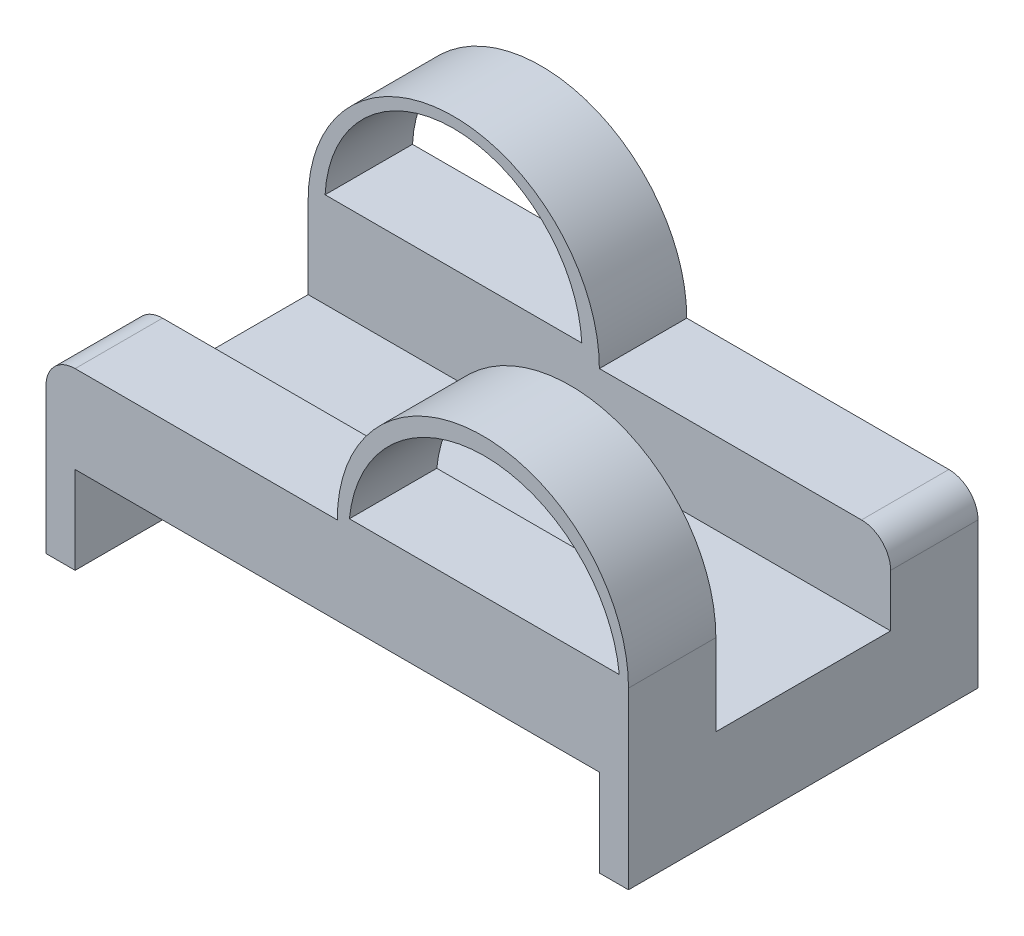
ISO-10303-21;
HEADER;
FILE_DESCRIPTION(('STEP AP214'),'2;1');
FILE_NAME('part.step','',(''),(''),'','','');
FILE_SCHEMA(('AUTOMOTIVE_DESIGN { 1 0 10303 214 1 1 1 1 }'));
ENDSEC;
DATA;
#1=APPLICATION_CONTEXT('core data for automotive mechanical design processes');
#2=APPLICATION_PROTOCOL_DEFINITION('international standard','automotive_design',2000,#1);
#3=PRODUCT_CONTEXT('',#1,'mechanical');
#4=PRODUCT('Part','Part','',(#3));
#5=PRODUCT_RELATED_PRODUCT_CATEGORY('part','',(#4));
#6=PRODUCT_DEFINITION_FORMATION('','',#4);
#7=PRODUCT_DEFINITION_CONTEXT('part definition',#1,'design');
#8=PRODUCT_DEFINITION('design','',#6,#7);
#9=PRODUCT_DEFINITION_SHAPE('','',#8);
#10=(LENGTH_UNIT() NAMED_UNIT(*) SI_UNIT(.MILLI.,.METRE.));
#11=(NAMED_UNIT(*) PLANE_ANGLE_UNIT() SI_UNIT($,.RADIAN.));
#12=(NAMED_UNIT(*) SI_UNIT($,.STERADIAN.) SOLID_ANGLE_UNIT());
#13=UNCERTAINTY_MEASURE_WITH_UNIT(LENGTH_MEASURE(1.E-05),#10,'distance_accuracy_value','');
#14=(GEOMETRIC_REPRESENTATION_CONTEXT(3) GLOBAL_UNCERTAINTY_ASSIGNED_CONTEXT((#13)) GLOBAL_UNIT_ASSIGNED_CONTEXT((#10,
#11,#12)) REPRESENTATION_CONTEXT('',''));
#15=CARTESIAN_POINT('',(0.,0.,0.));
#16=DIRECTION('',(0.,0.,1.));
#17=DIRECTION('',(1.,0.,0.));
#18=AXIS2_PLACEMENT_3D('',#15,#16,#17);
#19=CARTESIAN_POINT('',(-79.5714285714285,26.5714285714286,-60.));
#20=DIRECTION('',(0.,1.,0.));
#21=DIRECTION('',(0.,0.,1.));
#22=AXIS2_PLACEMENT_3D('',#19,#20,#21);
#23=PLANE('',#22);
#24=DIRECTION('',(-1.,0.,0.));
#25=VECTOR('',#24,1.);
#26=CARTESIAN_POINT('',(-79.5714285714285,26.5714285714286,-45.));
#27=LINE('',#26,#25);
#28=CARTESIAN_POINT('',(15.4285714285715,26.5714285714286,-45.));
#29=VERTEX_POINT('',#28);
#30=CARTESIAN_POINT('',(-29.5714285714285,26.5714285714286,-45.));
#31=VERTEX_POINT('',#30);
#32=EDGE_CURVE('E198',#29,#31,#27,.T.);
#33=ORIENTED_EDGE('',*,*,#32,.F.);
#34=DIRECTION('',(0.,0.,1.));
#35=VECTOR('',#34,1.);
#36=CARTESIAN_POINT('',(15.4285714285715,26.5714285714286,-60.));
#37=LINE('',#36,#35);
#38=CARTESIAN_POINT('',(15.4285714285715,26.5714285714286,-60.));
#39=VERTEX_POINT('',#38);
#40=EDGE_CURVE('E226',#29,#39,#37,.F.);
#41=ORIENTED_EDGE('',*,*,#40,.T.);
#42=DIRECTION('',(-1.,0.,0.));
#43=VECTOR('',#42,1.);
#44=CARTESIAN_POINT('',(-79.5714285714285,26.5714285714286,-60.));
#45=LINE('',#44,#43);
#46=CARTESIAN_POINT('',(-29.5714285714285,26.5714285714286,-60.));
#47=VERTEX_POINT('',#46);
#48=EDGE_CURVE('E239',#39,#47,#45,.T.);
#49=ORIENTED_EDGE('',*,*,#48,.T.);
#50=DIRECTION('',(0.,0.,-1.));
#51=VECTOR('',#50,1.);
#52=CARTESIAN_POINT('',(-29.5714285714285,26.5714285714286,-45.));
#53=LINE('',#52,#51);
#54=EDGE_CURVE('E256',#31,#47,#53,.T.);
#55=ORIENTED_EDGE('',*,*,#54,.F.);
#56=EDGE_LOOP('',(#33,#41,#49,#55));
#57=FACE_BOUND('',#56,.T.);
#58=ADVANCED_FACE('F39',(#57),#23,.T.);
#59=CARTESIAN_POINT('',(-74.5714285714285,-3.42857142857143,-60.));
#60=DIRECTION('',(0.,-1.,0.));
#61=DIRECTION('',(1.,0.,0.));
#62=AXIS2_PLACEMENT_3D('',#59,#60,#61);
#63=PLANE('',#62);
#64=DIRECTION('',(1.,0.,0.));
#65=VECTOR('',#64,1.);
#66=CARTESIAN_POINT('',(-74.5714285714285,-3.42857142857143,0.));
#67=LINE('',#66,#65);
#68=CARTESIAN_POINT('',(-79.5714285714285,-3.42857142857143,0.));
#69=VERTEX_POINT('',#68);
#70=CARTESIAN_POINT('',(-74.5714285714285,-3.42857142857143,0.));
#71=VERTEX_POINT('',#70);
#72=EDGE_CURVE('E320',#69,#71,#67,.T.);
#73=ORIENTED_EDGE('',*,*,#72,.F.);
#74=DIRECTION('',(0.,0.,1.));
#75=VECTOR('',#74,1.);
#76=CARTESIAN_POINT('',(-79.5714285714285,-3.42857142857143,-60.));
#77=LINE('',#76,#75);
#78=CARTESIAN_POINT('',(-79.5714285714285,-3.42857142857143,-60.));
#79=VERTEX_POINT('',#78);
#80=EDGE_CURVE('E375',#79,#69,#77,.T.);
#81=ORIENTED_EDGE('',*,*,#80,.F.);
#82=DIRECTION('',(1.,0.,0.));
#83=VECTOR('',#82,1.);
#84=CARTESIAN_POINT('',(-74.5714285714285,-3.42857142857143,-60.));
#85=LINE('',#84,#83);
#86=CARTESIAN_POINT('',(-74.5714285714285,-3.42857142857143,-60.));
#87=VERTEX_POINT('',#86);
#88=EDGE_CURVE('E321',#79,#87,#85,.T.);
#89=ORIENTED_EDGE('',*,*,#88,.T.);
#90=DIRECTION('',(0.,0.,1.));
#91=VECTOR('',#90,1.);
#92=CARTESIAN_POINT('',(-74.5714285714285,-3.42857142857143,-60.));
#93=LINE('',#92,#91);
#94=EDGE_CURVE('E346',#87,#71,#93,.T.);
#95=ORIENTED_EDGE('',*,*,#94,.T.);
#96=EDGE_LOOP('',(#73,#81,#89,#95));
#97=FACE_BOUND('',#96,.T.);
#98=ADVANCED_FACE('F439',(#97),#63,.T.);
#99=CARTESIAN_POINT('',(-79.5714285714285,-3.42857142857143,-60.));
#100=DIRECTION('',(-1.,0.,0.));
#101=DIRECTION('',(0.,0.,1.));
#102=AXIS2_PLACEMENT_3D('',#99,#100,#101);
#103=PLANE('',#102);
#104=DIRECTION('',(0.,0.,1.));
#105=VECTOR('',#104,1.);
#106=CARTESIAN_POINT('',(-79.5714285714285,12.5714285714286,-45.));
#107=LINE('',#106,#105);
#108=CARTESIAN_POINT('',(-79.5714285714285,12.5714285714286,-45.));
#109=VERTEX_POINT('',#108);
#110=CARTESIAN_POINT('',(-79.5714285714285,12.5714285714286,-15.));
#111=VERTEX_POINT('',#110);
#112=EDGE_CURVE('E425',#109,#111,#107,.T.);
#113=ORIENTED_EDGE('',*,*,#112,.F.);
#114=DIRECTION('',(0.,1.,0.));
#115=VECTOR('',#114,1.);
#116=CARTESIAN_POINT('',(-79.5714285714285,26.5714285714286,-45.));
#117=LINE('',#116,#115);
#118=CARTESIAN_POINT('',(-79.5714285714285,26.5714285714286,-45.));
#119=VERTEX_POINT('',#118);
#120=EDGE_CURVE('E60',#109,#119,#117,.T.);
#121=ORIENTED_EDGE('',*,*,#120,.T.);
#122=DIRECTION('',(0.,0.,1.));
#123=VECTOR('',#122,1.);
#124=CARTESIAN_POINT('',(-79.5714285714285,26.5714285714286,-60.));
#125=LINE('',#124,#123);
#126=CARTESIAN_POINT('',(-79.5714285714285,26.5714285714286,-60.));
#127=VERTEX_POINT('',#126);
#128=EDGE_CURVE('E379',#127,#119,#125,.T.);
#129=ORIENTED_EDGE('',*,*,#128,.F.);
#130=DIRECTION('',(0.,-1.,0.));
#131=VECTOR('',#130,1.);
#132=CARTESIAN_POINT('',(-79.5714285714285,-3.42857142857143,-60.));
#133=LINE('',#132,#131);
#134=EDGE_CURVE('E342',#127,#79,#133,.T.);
#135=ORIENTED_EDGE('',*,*,#134,.T.);
#136=ORIENTED_EDGE('',*,*,#80,.T.);
#137=DIRECTION('',(0.,-1.,0.));
#138=VECTOR('',#137,1.);
#139=CARTESIAN_POINT('',(-79.5714285714285,-3.42857142857143,0.));
#140=LINE('',#139,#138);
#141=CARTESIAN_POINT('',(-79.5714285714285,21.5714285714286,0.));
#142=VERTEX_POINT('',#141);
#143=EDGE_CURVE('E326',#142,#69,#140,.T.);
#144=ORIENTED_EDGE('',*,*,#143,.F.);
#145=DIRECTION('',(0.,0.,1.));
#146=VECTOR('',#145,1.);
#147=CARTESIAN_POINT('',(-79.5714285714285,21.5714285714286,-60.));
#148=LINE('',#147,#146);
#149=CARTESIAN_POINT('',(-79.5714285714285,21.5714285714286,-15.));
#150=VERTEX_POINT('',#149);
#151=EDGE_CURVE('E216',#142,#150,#148,.F.);
#152=ORIENTED_EDGE('',*,*,#151,.T.);
#153=DIRECTION('',(0.,1.,0.));
#154=VECTOR('',#153,1.);
#155=CARTESIAN_POINT('',(-79.5714285714285,11.5714285714286,-15.));
#156=LINE('',#155,#154);
#157=EDGE_CURVE('E180',#111,#150,#156,.T.);
#158=ORIENTED_EDGE('',*,*,#157,.F.);
#159=EDGE_LOOP('',(#113,#121,#129,#135,#136,#144,#152,#158));
#160=FACE_BOUND('',#159,.T.);
#161=ADVANCED_FACE('F434',(#160),#103,.T.);
#162=DIRECTION('',(1.,0.,0.));
#163=VECTOR('',#162,1.);
#164=CARTESIAN_POINT('',(-79.5714285714285,26.5714285714286,-15.));
#165=LINE('',#164,#163);
#166=CARTESIAN_POINT('',(-74.5714285714285,26.5714285714286,-15.));
#167=VERTEX_POINT('',#166);
#168=CARTESIAN_POINT('',(-29.5714285714285,26.5714285714286,-15.));
#169=VERTEX_POINT('',#168);
#170=EDGE_CURVE('E177',#167,#169,#165,.T.);
#171=ORIENTED_EDGE('',*,*,#170,.F.);
#172=DIRECTION('',(0.,0.,1.));
#173=VECTOR('',#172,1.);
#174=CARTESIAN_POINT('',(-74.5714285714285,26.5714285714286,-60.));
#175=LINE('',#174,#173);
#176=CARTESIAN_POINT('',(-74.5714285714285,26.5714285714286,0.));
#177=VERTEX_POINT('',#176);
#178=EDGE_CURVE('E193',#167,#177,#175,.T.);
#179=ORIENTED_EDGE('',*,*,#178,.T.);
#180=DIRECTION('',(-1.,0.,0.));
#181=VECTOR('',#180,1.);
#182=CARTESIAN_POINT('',(-79.5714285714285,26.5714285714286,0.));
#183=LINE('',#182,#181);
#184=CARTESIAN_POINT('',(-29.5714285714285,26.5714285714286,0.));
#185=VERTEX_POINT('',#184);
#186=EDGE_CURVE('E370',#185,#177,#183,.T.);
#187=ORIENTED_EDGE('',*,*,#186,.F.);
#188=DIRECTION('',(0.,0.,1.));
#189=VECTOR('',#188,1.);
#190=CARTESIAN_POINT('',(-29.5714285714285,26.5714285714286,-15.));
#191=LINE('',#190,#189);
#192=EDGE_CURVE('E196',#169,#185,#191,.T.);
#193=ORIENTED_EDGE('',*,*,#192,.F.);
#194=EDGE_LOOP('',(#171,#179,#187,#193));
#195=FACE_BOUND('',#194,.T.);
#196=ADVANCED_FACE('F191',(#195),#23,.T.);
#197=CARTESIAN_POINT('',(20.4285714285715,26.5714285714286,-60.));
#198=DIRECTION('',(1.,0.,0.));
#199=DIRECTION('',(0.,0.,-1.));
#200=AXIS2_PLACEMENT_3D('',#197,#198,#199);
#201=PLANE('',#200);
#202=DIRECTION('',(0.,1.,0.));
#203=VECTOR('',#202,1.);
#204=CARTESIAN_POINT('',(20.4285714285715,11.5714285714286,-45.));
#205=LINE('',#204,#203);
#206=CARTESIAN_POINT('',(20.4285714285715,12.5714285714286,-45.));
#207=VERTEX_POINT('',#206);
#208=CARTESIAN_POINT('',(20.4285714285715,21.5714285714286,-45.));
#209=VERTEX_POINT('',#208);
#210=EDGE_CURVE('E187',#207,#209,#205,.T.);
#211=ORIENTED_EDGE('',*,*,#210,.F.);
#212=DIRECTION('',(0.,0.,-1.));
#213=VECTOR('',#212,1.);
#214=CARTESIAN_POINT('',(20.4285714285715,12.5714285714286,-45.));
#215=LINE('',#214,#213);
#216=CARTESIAN_POINT('',(20.4285714285715,12.5714285714286,-15.));
#217=VERTEX_POINT('',#216);
#218=EDGE_CURVE('E423',#217,#207,#215,.T.);
#219=ORIENTED_EDGE('',*,*,#218,.F.);
#220=DIRECTION('',(0.,1.,0.));
#221=VECTOR('',#220,1.);
#222=CARTESIAN_POINT('',(20.4285714285715,26.5714285714286,-15.));
#223=LINE('',#222,#221);
#224=CARTESIAN_POINT('',(20.4285714285715,26.5714285714286,-15.));
#225=VERTEX_POINT('',#224);
#226=EDGE_CURVE('E219',#217,#225,#223,.T.);
#227=ORIENTED_EDGE('',*,*,#226,.T.);
#228=DIRECTION('',(0.,0.,1.));
#229=VECTOR('',#228,1.);
#230=CARTESIAN_POINT('',(20.4285714285715,26.5714285714286,-15.));
#231=LINE('',#230,#229);
#232=CARTESIAN_POINT('',(20.4285714285715,26.5714285714286,0.));
#233=VERTEX_POINT('',#232);
#234=EDGE_CURVE('E306',#225,#233,#231,.T.);
#235=ORIENTED_EDGE('',*,*,#234,.T.);
#236=DIRECTION('',(0.,1.,0.));
#237=VECTOR('',#236,1.);
#238=CARTESIAN_POINT('',(20.4285714285715,26.5714285714286,0.));
#239=LINE('',#238,#237);
#240=CARTESIAN_POINT('',(20.4285714285715,-3.42857142857142,0.));
#241=VERTEX_POINT('',#240);
#242=EDGE_CURVE('E366',#241,#233,#239,.T.);
#243=ORIENTED_EDGE('',*,*,#242,.F.);
#244=DIRECTION('',(0.,0.,1.));
#245=VECTOR('',#244,1.);
#246=CARTESIAN_POINT('',(20.4285714285715,-3.42857142857142,-60.));
#247=LINE('',#246,#245);
#248=CARTESIAN_POINT('',(20.4285714285715,-3.42857142857142,-60.));
#249=VERTEX_POINT('',#248);
#250=EDGE_CURVE('E246',#249,#241,#247,.T.);
#251=ORIENTED_EDGE('',*,*,#250,.F.);
#252=DIRECTION('',(0.,1.,0.));
#253=VECTOR('',#252,1.);
#254=CARTESIAN_POINT('',(20.4285714285715,26.5714285714286,-60.));
#255=LINE('',#254,#253);
#256=CARTESIAN_POINT('',(20.4285714285715,21.5714285714286,-60.));
#257=VERTEX_POINT('',#256);
#258=EDGE_CURVE('E236',#249,#257,#255,.T.);
#259=ORIENTED_EDGE('',*,*,#258,.T.);
#260=DIRECTION('',(0.,0.,1.));
#261=VECTOR('',#260,1.);
#262=CARTESIAN_POINT('',(20.4285714285715,21.5714285714286,-60.));
#263=LINE('',#262,#261);
#264=EDGE_CURVE('E222',#257,#209,#263,.T.);
#265=ORIENTED_EDGE('',*,*,#264,.T.);
#266=EDGE_LOOP('',(#211,#219,#227,#235,#243,#251,#259,#265));
#267=FACE_BOUND('',#266,.T.);
#268=ADVANCED_FACE('F244',(#267),#201,.T.);
#269=CARTESIAN_POINT('',(20.4285714285715,-3.42857142857142,-60.));
#270=DIRECTION('',(0.,-1.,0.));
#271=DIRECTION('',(0.,0.,-1.));
#272=AXIS2_PLACEMENT_3D('',#269,#270,#271);
#273=PLANE('',#272);
#274=DIRECTION('',(1.,0.,0.));
#275=VECTOR('',#274,1.);
#276=CARTESIAN_POINT('',(20.4285714285715,-3.42857142857142,0.));
#277=LINE('',#276,#275);
#278=CARTESIAN_POINT('',(15.4285714285715,-3.42857142857142,0.));
#279=VERTEX_POINT('',#278);
#280=EDGE_CURVE('E362',#279,#241,#277,.T.);
#281=ORIENTED_EDGE('',*,*,#280,.F.);
#282=DIRECTION('',(0.,0.,1.));
#283=VECTOR('',#282,1.);
#284=CARTESIAN_POINT('',(15.4285714285715,-3.42857142857142,-60.));
#285=LINE('',#284,#283);
#286=CARTESIAN_POINT('',(15.4285714285715,-3.42857142857142,-60.));
#287=VERTEX_POINT('',#286);
#288=EDGE_CURVE('E385',#287,#279,#285,.T.);
#289=ORIENTED_EDGE('',*,*,#288,.F.);
#290=DIRECTION('',(1.,0.,0.));
#291=VECTOR('',#290,1.);
#292=CARTESIAN_POINT('',(20.4285714285715,-3.42857142857142,-60.));
#293=LINE('',#292,#291);
#294=EDGE_CURVE('E248',#287,#249,#293,.T.);
#295=ORIENTED_EDGE('',*,*,#294,.T.);
#296=ORIENTED_EDGE('',*,*,#250,.T.);
#297=EDGE_LOOP('',(#281,#289,#295,#296));
#298=FACE_BOUND('',#297,.T.);
#299=ADVANCED_FACE('F454',(#298),#273,.T.);
#300=CARTESIAN_POINT('',(15.4285714285715,11.5714285714286,-60.));
#301=DIRECTION('',(-1.,0.,0.));
#302=DIRECTION('',(0.,-1.,0.));
#303=AXIS2_PLACEMENT_3D('',#300,#301,#302);
#304=PLANE('',#303);
#305=DIRECTION('',(0.,-1.,0.));
#306=VECTOR('',#305,1.);
#307=CARTESIAN_POINT('',(15.4285714285715,11.5714285714286,0.));
#308=LINE('',#307,#306);
#309=CARTESIAN_POINT('',(15.4285714285715,11.5714285714286,0.));
#310=VERTEX_POINT('',#309);
#311=EDGE_CURVE('E358',#310,#279,#308,.T.);
#312=ORIENTED_EDGE('',*,*,#311,.F.);
#313=DIRECTION('',(0.,0.,1.));
#314=VECTOR('',#313,1.);
#315=CARTESIAN_POINT('',(15.4285714285715,11.5714285714286,-60.));
#316=LINE('',#315,#314);
#317=CARTESIAN_POINT('',(15.4285714285715,11.5714285714286,-60.));
#318=VERTEX_POINT('',#317);
#319=EDGE_CURVE('E388',#318,#310,#316,.T.);
#320=ORIENTED_EDGE('',*,*,#319,.F.);
#321=DIRECTION('',(0.,-1.,0.));
#322=VECTOR('',#321,1.);
#323=CARTESIAN_POINT('',(15.4285714285715,11.5714285714286,-60.));
#324=LINE('',#323,#322);
#325=EDGE_CURVE('E334',#318,#287,#324,.T.);
#326=ORIENTED_EDGE('',*,*,#325,.T.);
#327=ORIENTED_EDGE('',*,*,#288,.T.);
#328=EDGE_LOOP('',(#312,#320,#326,#327));
#329=FACE_BOUND('',#328,.T.);
#330=ADVANCED_FACE('F451',(#329),#304,.T.);
#331=CARTESIAN_POINT('',(-74.5714285714285,11.5714285714286,-60.));
#332=DIRECTION('',(0.,-1.,0.));
#333=DIRECTION('',(0.,0.,-1.));
#334=AXIS2_PLACEMENT_3D('',#331,#332,#333);
#335=PLANE('',#334);
#336=DIRECTION('',(1.,0.,0.));
#337=VECTOR('',#336,1.);
#338=CARTESIAN_POINT('',(-74.5714285714285,11.5714285714286,0.));
#339=LINE('',#338,#337);
#340=CARTESIAN_POINT('',(-74.5714285714285,11.5714285714286,0.));
#341=VERTEX_POINT('',#340);
#342=EDGE_CURVE('E354',#341,#310,#339,.T.);
#343=ORIENTED_EDGE('',*,*,#342,.F.);
#344=DIRECTION('',(0.,0.,1.));
#345=VECTOR('',#344,1.);
#346=CARTESIAN_POINT('',(-74.5714285714285,11.5714285714286,-60.));
#347=LINE('',#346,#345);
#348=CARTESIAN_POINT('',(-74.5714285714285,11.5714285714286,-60.));
#349=VERTEX_POINT('',#348);
#350=EDGE_CURVE('E391',#349,#341,#347,.T.);
#351=ORIENTED_EDGE('',*,*,#350,.F.);
#352=DIRECTION('',(1.,0.,0.));
#353=VECTOR('',#352,1.);
#354=CARTESIAN_POINT('',(-74.5714285714285,11.5714285714286,-60.));
#355=LINE('',#354,#353);
#356=EDGE_CURVE('E330',#349,#318,#355,.T.);
#357=ORIENTED_EDGE('',*,*,#356,.T.);
#358=ORIENTED_EDGE('',*,*,#319,.T.);
#359=EDGE_LOOP('',(#343,#351,#357,#358));
#360=FACE_BOUND('',#359,.T.);
#361=ADVANCED_FACE('F447',(#360),#335,.T.);
#362=CARTESIAN_POINT('',(-74.5714285714285,-3.42857142857143,-60.));
#363=DIRECTION('',(1.,0.,0.));
#364=DIRECTION('',(0.,0.,-1.));
#365=AXIS2_PLACEMENT_3D('',#362,#363,#364);
#366=PLANE('',#365);
#367=DIRECTION('',(0.,1.,0.));
#368=VECTOR('',#367,1.);
#369=CARTESIAN_POINT('',(-74.5714285714285,-3.42857142857143,0.));
#370=LINE('',#369,#368);
#371=EDGE_CURVE('E350',#71,#341,#370,.T.);
#372=ORIENTED_EDGE('',*,*,#371,.F.);
#373=ORIENTED_EDGE('',*,*,#94,.F.);
#374=DIRECTION('',(0.,1.,0.));
#375=VECTOR('',#374,1.);
#376=CARTESIAN_POINT('',(-74.5714285714285,-3.42857142857143,-60.));
#377=LINE('',#376,#375);
#378=EDGE_CURVE('E325',#87,#349,#377,.T.);
#379=ORIENTED_EDGE('',*,*,#378,.T.);
#380=ORIENTED_EDGE('',*,*,#350,.T.);
#381=EDGE_LOOP('',(#372,#373,#379,#380));
#382=FACE_BOUND('',#381,.T.);
#383=ADVANCED_FACE('F443',(#382),#366,.T.);
#384=CARTESIAN_POINT('',(0.,0.,-60.));
#385=DIRECTION('',(0.,0.,-1.));
#386=DIRECTION('',(-1.,0.,0.));
#387=AXIS2_PLACEMENT_3D('',#384,#385,#386);
#388=PLANE('',#387);
#389=CARTESIAN_POINT('',(-54.6247948480572,27.7047487480097,-60.));
#390=DIRECTION('',(0.,0.,-1.));
#391=DIRECTION('',(-1.,0.,0.));
#392=AXIS2_PLACEMENT_3D('',#389,#390,#391);
#393=CIRCLE('',#392,22.0634805595652);
#394=CARTESIAN_POINT('',(-76.6575424955888,28.8688816882297,-60.));
#395=VERTEX_POINT('',#394);
#396=CARTESIAN_POINT('',(-32.5920472005256,28.8688816882297,-60.));
#397=VERTEX_POINT('',#396);
#398=EDGE_CURVE('E282',#395,#397,#393,.T.);
#399=ORIENTED_EDGE('',*,*,#398,.F.);
#400=DIRECTION('',(-1.,0.,0.));
#401=VECTOR('',#400,1.);
#402=CARTESIAN_POINT('',(0.,28.8688816882297,-60.));
#403=LINE('',#402,#401);
#404=EDGE_CURVE('E276',#397,#395,#403,.T.);
#405=ORIENTED_EDGE('',*,*,#404,.F.);
#406=EDGE_LOOP('',(#399,#405));
#407=FACE_BOUND('',#406,.T.);
#408=ORIENTED_EDGE('',*,*,#48,.F.);
#409=CARTESIAN_POINT('',(15.4285714285715,21.5714285714286,-60.));
#410=DIRECTION('',(0.,0.,-1.));
#411=DIRECTION('',(-1.,0.,0.));
#412=AXIS2_PLACEMENT_3D('',#409,#410,#411);
#413=CIRCLE('',#412,5.);
#414=EDGE_CURVE('E48',#39,#257,#413,.T.);
#415=ORIENTED_EDGE('',*,*,#414,.T.);
#416=ORIENTED_EDGE('',*,*,#258,.F.);
#417=ORIENTED_EDGE('',*,*,#294,.F.);
#418=ORIENTED_EDGE('',*,*,#325,.F.);
#419=ORIENTED_EDGE('',*,*,#356,.F.);
#420=ORIENTED_EDGE('',*,*,#378,.F.);
#421=ORIENTED_EDGE('',*,*,#88,.F.);
#422=ORIENTED_EDGE('',*,*,#134,.F.);
#423=CARTESIAN_POINT('',(-54.5714285714285,26.5714285714286,-60.));
#424=DIRECTION('',(0.,0.,-1.));
#425=DIRECTION('',(-1.,0.,0.));
#426=AXIS2_PLACEMENT_3D('',#423,#424,#425);
#427=CIRCLE('',#426,25.);
#428=EDGE_CURVE('E310',#127,#47,#427,.T.);
#429=ORIENTED_EDGE('',*,*,#428,.T.);
#430=EDGE_LOOP('',(#408,#415,#416,#417,#418,#419,#420,#421,#422,#429));
#431=FACE_BOUND('',#430,.T.);
#432=ADVANCED_FACE('F234',(#407,#431),#388,.T.);
#433=CARTESIAN_POINT('',(0.,0.,0.));
#434=DIRECTION('',(0.,0.,-1.));
#435=DIRECTION('',(-1.,0.,0.));
#436=AXIS2_PLACEMENT_3D('',#433,#434,#435);
#437=PLANE('',#436);
#438=DIRECTION('',(1.,0.,0.));
#439=VECTOR('',#438,1.);
#440=CARTESIAN_POINT('',(-27.4866872799802,27.7877235493752,0.));
#441=LINE('',#440,#439);
#442=CARTESIAN_POINT('',(-27.4866872799802,27.7877235493752,0.));
#443=VERTEX_POINT('',#442);
#444=CARTESIAN_POINT('',(18.8431234450857,27.7877235493752,0.));
#445=VERTEX_POINT('',#444);
#446=EDGE_CURVE('E289',#443,#445,#441,.T.);
#447=ORIENTED_EDGE('',*,*,#446,.F.);
#448=CARTESIAN_POINT('',(-4.32178191744725,25.4463047793192,0.));
#449=DIRECTION('',(0.,0.,1.));
#450=DIRECTION('',(1.,0.,0.));
#451=AXIS2_PLACEMENT_3D('',#448,#449,#450);
#452=CIRCLE('',#451,23.2829354315963);
#453=EDGE_CURVE('E286',#445,#443,#452,.T.);
#454=ORIENTED_EDGE('',*,*,#453,.F.);
#455=EDGE_LOOP('',(#447,#454));
#456=FACE_BOUND('',#455,.T.);
#457=ORIENTED_EDGE('',*,*,#186,.T.);
#458=CARTESIAN_POINT('',(-74.5714285714285,21.5714285714286,0.));
#459=DIRECTION('',(0.,0.,-1.));
#460=DIRECTION('',(-1.,0.,0.));
#461=AXIS2_PLACEMENT_3D('',#458,#459,#460);
#462=CIRCLE('',#461,5.);
#463=EDGE_CURVE('E201',#177,#142,#462,.F.);
#464=ORIENTED_EDGE('',*,*,#463,.T.);
#465=ORIENTED_EDGE('',*,*,#143,.T.);
#466=ORIENTED_EDGE('',*,*,#72,.T.);
#467=ORIENTED_EDGE('',*,*,#371,.T.);
#468=ORIENTED_EDGE('',*,*,#342,.T.);
#469=ORIENTED_EDGE('',*,*,#311,.T.);
#470=ORIENTED_EDGE('',*,*,#280,.T.);
#471=ORIENTED_EDGE('',*,*,#242,.T.);
#472=CARTESIAN_POINT('',(-4.57142857142854,26.5714285714286,0.));
#473=DIRECTION('',(0.,0.,1.));
#474=DIRECTION('',(1.,0.,0.));
#475=AXIS2_PLACEMENT_3D('',#472,#473,#474);
#476=CIRCLE('',#475,25.);
#477=EDGE_CURVE('E297',#233,#185,#476,.T.);
#478=ORIENTED_EDGE('',*,*,#477,.T.);
#479=EDGE_LOOP('',(#457,#464,#465,#466,#467,#468,#469,#470,#471,#478));
#480=FACE_BOUND('',#479,.T.);
#481=ADVANCED_FACE('F407',(#456,#480),#437,.F.);
#482=CARTESIAN_POINT('',(-54.5714285714285,26.5714285714286,-45.));
#483=DIRECTION('',(0.,0.,-1.));
#484=DIRECTION('',(-1.,0.,0.));
#485=AXIS2_PLACEMENT_3D('',#482,#483,#484);
#486=CYLINDRICAL_SURFACE('',#485,25.);
#487=ORIENTED_EDGE('',*,*,#428,.F.);
#488=ORIENTED_EDGE('',*,*,#128,.T.);
#489=CARTESIAN_POINT('',(-54.5714285714285,26.5714285714286,-45.));
#490=DIRECTION('',(0.,0.,-1.));
#491=DIRECTION('',(-1.,0.,0.));
#492=AXIS2_PLACEMENT_3D('',#489,#490,#491);
#493=CIRCLE('',#492,25.);
#494=EDGE_CURVE('E313',#119,#31,#493,.T.);
#495=ORIENTED_EDGE('',*,*,#494,.T.);
#496=ORIENTED_EDGE('',*,*,#54,.T.);
#497=EDGE_LOOP('',(#487,#488,#495,#496));
#498=FACE_BOUND('',#497,.T.);
#499=ADVANCED_FACE('F410',(#498),#486,.T.);
#500=CARTESIAN_POINT('',(-54.5714285714285,26.5714285714286,-45.));
#501=DIRECTION('',(0.,0.,-1.));
#502=DIRECTION('',(-1.,0.,0.));
#503=AXIS2_PLACEMENT_3D('',#500,#501,#502);
#504=PLANE('',#503);
#505=DIRECTION('',(1.,0.,0.));
#506=VECTOR('',#505,1.);
#507=CARTESIAN_POINT('',(-76.6575424955888,28.8688816882297,-45.));
#508=LINE('',#507,#506);
#509=CARTESIAN_POINT('',(-76.6575424955888,28.8688816882297,-45.));
#510=VERTEX_POINT('',#509);
#511=CARTESIAN_POINT('',(-32.5920472005256,28.8688816882297,-45.));
#512=VERTEX_POINT('',#511);
#513=EDGE_CURVE('E268',#510,#512,#508,.T.);
#514=ORIENTED_EDGE('',*,*,#513,.F.);
#515=CARTESIAN_POINT('',(-54.6247948480572,27.7047487480097,-45.));
#516=DIRECTION('',(0.,0.,1.));
#517=DIRECTION('',(1.,0.,0.));
#518=AXIS2_PLACEMENT_3D('',#515,#516,#517);
#519=CIRCLE('',#518,22.0634805595652);
#520=EDGE_CURVE('E186',#512,#510,#519,.T.);
#521=ORIENTED_EDGE('',*,*,#520,.F.);
#522=EDGE_LOOP('',(#514,#521));
#523=FACE_BOUND('',#522,.T.);
#524=ORIENTED_EDGE('',*,*,#120,.F.);
#525=DIRECTION('',(-1.,0.,0.));
#526=VECTOR('',#525,1.);
#527=CARTESIAN_POINT('',(-79.5714285714285,12.5714285714286,-45.));
#528=LINE('',#527,#526);
#529=EDGE_CURVE('E55',#207,#109,#528,.T.);
#530=ORIENTED_EDGE('',*,*,#529,.F.);
#531=ORIENTED_EDGE('',*,*,#210,.T.);
#532=CARTESIAN_POINT('',(15.4285714285715,21.5714285714286,-45.));
#533=DIRECTION('',(0.,0.,-1.));
#534=DIRECTION('',(-1.,0.,0.));
#535=AXIS2_PLACEMENT_3D('',#532,#533,#534);
#536=CIRCLE('',#535,5.);
#537=EDGE_CURVE('E11',#209,#29,#536,.F.);
#538=ORIENTED_EDGE('',*,*,#537,.T.);
#539=ORIENTED_EDGE('',*,*,#32,.T.);
#540=ORIENTED_EDGE('',*,*,#494,.F.);
#541=EDGE_LOOP('',(#524,#530,#531,#538,#539,#540));
#542=FACE_BOUND('',#541,.T.);
#543=ADVANCED_FACE('F252',(#523,#542),#504,.F.);
#544=CARTESIAN_POINT('',(-4.57142857142854,26.5714285714286,-15.));
#545=DIRECTION('',(0.,0.,1.));
#546=DIRECTION('',(1.,0.,0.));
#547=AXIS2_PLACEMENT_3D('',#544,#545,#546);
#548=CYLINDRICAL_SURFACE('',#547,25.);
#549=ORIENTED_EDGE('',*,*,#477,.F.);
#550=ORIENTED_EDGE('',*,*,#234,.F.);
#551=CARTESIAN_POINT('',(-4.57142857142854,26.5714285714286,-15.));
#552=DIRECTION('',(0.,0.,1.));
#553=DIRECTION('',(1.,0.,0.));
#554=AXIS2_PLACEMENT_3D('',#551,#552,#553);
#555=CIRCLE('',#554,25.);
#556=EDGE_CURVE('E301',#225,#169,#555,.T.);
#557=ORIENTED_EDGE('',*,*,#556,.T.);
#558=ORIENTED_EDGE('',*,*,#192,.T.);
#559=EDGE_LOOP('',(#549,#550,#557,#558));
#560=FACE_BOUND('',#559,.T.);
#561=ADVANCED_FACE('F415',(#560),#548,.T.);
#562=CARTESIAN_POINT('',(-4.57142857142854,26.5714285714286,-15.));
#563=DIRECTION('',(0.,0.,1.));
#564=DIRECTION('',(1.,0.,0.));
#565=AXIS2_PLACEMENT_3D('',#562,#563,#564);
#566=PLANE('',#565);
#567=DIRECTION('',(1.,0.,0.));
#568=VECTOR('',#567,1.);
#569=CARTESIAN_POINT('',(-4.57142857142854,27.7877235493752,-15.));
#570=LINE('',#569,#568);
#571=CARTESIAN_POINT('',(-27.4866872799802,27.7877235493752,-15.));
#572=VERTEX_POINT('',#571);
#573=CARTESIAN_POINT('',(18.8431234450857,27.7877235493752,-15.));
#574=VERTEX_POINT('',#573);
#575=EDGE_CURVE('E210',#572,#574,#570,.T.);
#576=ORIENTED_EDGE('',*,*,#575,.T.);
#577=CARTESIAN_POINT('',(-4.32178191744725,25.4463047793192,-15.));
#578=DIRECTION('',(0.,0.,1.));
#579=DIRECTION('',(1.,0.,0.));
#580=AXIS2_PLACEMENT_3D('',#577,#578,#579);
#581=CIRCLE('',#580,23.2829354315963);
#582=EDGE_CURVE('E204',#574,#572,#581,.T.);
#583=ORIENTED_EDGE('',*,*,#582,.T.);
#584=EDGE_LOOP('',(#576,#583));
#585=FACE_BOUND('',#584,.T.);
#586=ORIENTED_EDGE('',*,*,#226,.F.);
#587=DIRECTION('',(1.,0.,0.));
#588=VECTOR('',#587,1.);
#589=CARTESIAN_POINT('',(-79.5714285714285,12.5714285714286,-15.));
#590=LINE('',#589,#588);
#591=EDGE_CURVE('E417',#111,#217,#590,.T.);
#592=ORIENTED_EDGE('',*,*,#591,.F.);
#593=ORIENTED_EDGE('',*,*,#157,.T.);
#594=CARTESIAN_POINT('',(-74.5714285714285,21.5714285714286,-15.));
#595=DIRECTION('',(0.,0.,1.));
#596=DIRECTION('',(1.,0.,0.));
#597=AXIS2_PLACEMENT_3D('',#594,#595,#596);
#598=CIRCLE('',#597,5.);
#599=EDGE_CURVE('E173',#150,#167,#598,.F.);
#600=ORIENTED_EDGE('',*,*,#599,.T.);
#601=ORIENTED_EDGE('',*,*,#170,.T.);
#602=ORIENTED_EDGE('',*,*,#556,.F.);
#603=EDGE_LOOP('',(#586,#592,#593,#600,#601,#602));
#604=FACE_BOUND('',#603,.T.);
#605=ADVANCED_FACE('F175',(#585,#604),#566,.F.);
#606=CARTESIAN_POINT('',(-4.32178191744725,25.4463047793192,-25.));
#607=DIRECTION('',(0.,0.,1.));
#608=DIRECTION('',(1.,0.,0.));
#609=AXIS2_PLACEMENT_3D('',#606,#607,#608);
#610=CYLINDRICAL_SURFACE('',#609,23.2829354315963);
#611=DIRECTION('',(0.,0.,1.));
#612=VECTOR('',#611,1.);
#613=CARTESIAN_POINT('',(18.8431234450857,27.7877235493752,-25.));
#614=LINE('',#613,#612);
#615=EDGE_CURVE('E294',#574,#445,#614,.T.);
#616=ORIENTED_EDGE('',*,*,#615,.T.);
#617=ORIENTED_EDGE('',*,*,#453,.T.);
#618=DIRECTION('',(0.,0.,1.));
#619=VECTOR('',#618,1.);
#620=CARTESIAN_POINT('',(-27.4866872799802,27.7877235493752,-25.));
#621=LINE('',#620,#619);
#622=EDGE_CURVE('E293',#572,#443,#621,.T.);
#623=ORIENTED_EDGE('',*,*,#622,.F.);
#624=ORIENTED_EDGE('',*,*,#582,.F.);
#625=EDGE_LOOP('',(#616,#617,#623,#624));
#626=FACE_BOUND('',#625,.T.);
#627=ADVANCED_FACE('F404',(#626),#610,.F.);
#628=CARTESIAN_POINT('',(-27.4866872799802,27.7877235493752,-25.));
#629=DIRECTION('',(0.,-1.,0.));
#630=DIRECTION('',(0.,0.,-1.));
#631=AXIS2_PLACEMENT_3D('',#628,#629,#630);
#632=PLANE('',#631);
#633=ORIENTED_EDGE('',*,*,#622,.T.);
#634=ORIENTED_EDGE('',*,*,#446,.T.);
#635=ORIENTED_EDGE('',*,*,#615,.F.);
#636=ORIENTED_EDGE('',*,*,#575,.F.);
#637=EDGE_LOOP('',(#633,#634,#635,#636));
#638=FACE_BOUND('',#637,.T.);
#639=ADVANCED_FACE('F401',(#638),#632,.F.);
#640=CARTESIAN_POINT('',(-54.6247948480572,27.7047487480097,-70.));
#641=DIRECTION('',(0.,0.,1.));
#642=DIRECTION('',(1.,0.,0.));
#643=AXIS2_PLACEMENT_3D('',#640,#641,#642);
#644=CYLINDRICAL_SURFACE('',#643,22.0634805595652);
#645=ORIENTED_EDGE('',*,*,#398,.T.);
#646=DIRECTION('',(0.,0.,1.));
#647=VECTOR('',#646,1.);
#648=CARTESIAN_POINT('',(-32.5920472005256,28.8688816882297,-70.));
#649=LINE('',#648,#647);
#650=EDGE_CURVE('E273',#397,#512,#649,.T.);
#651=ORIENTED_EDGE('',*,*,#650,.T.);
#652=ORIENTED_EDGE('',*,*,#520,.T.);
#653=DIRECTION('',(0.,0.,1.));
#654=VECTOR('',#653,1.);
#655=CARTESIAN_POINT('',(-76.6575424955888,28.8688816882297,-70.));
#656=LINE('',#655,#654);
#657=EDGE_CURVE('E272',#395,#510,#656,.T.);
#658=ORIENTED_EDGE('',*,*,#657,.F.);
#659=EDGE_LOOP('',(#645,#651,#652,#658));
#660=FACE_BOUND('',#659,.T.);
#661=ADVANCED_FACE('F490',(#660),#644,.F.);
#662=CARTESIAN_POINT('',(-76.6575424955888,28.8688816882297,-70.));
#663=DIRECTION('',(0.,-1.,0.));
#664=DIRECTION('',(0.,0.,-1.));
#665=AXIS2_PLACEMENT_3D('',#662,#663,#664);
#666=PLANE('',#665);
#667=ORIENTED_EDGE('',*,*,#404,.T.);
#668=ORIENTED_EDGE('',*,*,#657,.T.);
#669=ORIENTED_EDGE('',*,*,#513,.T.);
#670=ORIENTED_EDGE('',*,*,#650,.F.);
#671=EDGE_LOOP('',(#667,#668,#669,#670));
#672=FACE_BOUND('',#671,.T.);
#673=ADVANCED_FACE('F494',(#672),#666,.F.);
#674=CARTESIAN_POINT('',(-74.5714285714285,21.5714285714286,-60.));
#675=DIRECTION('',(0.,0.,1.));
#676=DIRECTION('',(1.,0.,0.));
#677=AXIS2_PLACEMENT_3D('',#674,#675,#676);
#678=CYLINDRICAL_SURFACE('',#677,5.);
#679=ORIENTED_EDGE('',*,*,#599,.F.);
#680=ORIENTED_EDGE('',*,*,#151,.F.);
#681=ORIENTED_EDGE('',*,*,#463,.F.);
#682=ORIENTED_EDGE('',*,*,#178,.F.);
#683=EDGE_LOOP('',(#679,#680,#681,#682));
#684=FACE_BOUND('',#683,.T.);
#685=ADVANCED_FACE('F200',(#684),#678,.T.);
#686=CARTESIAN_POINT('',(15.4285714285715,21.5714285714286,-60.));
#687=DIRECTION('',(0.,0.,1.));
#688=DIRECTION('',(1.,0.,0.));
#689=AXIS2_PLACEMENT_3D('',#686,#687,#688);
#690=CYLINDRICAL_SURFACE('',#689,5.);
#691=ORIENTED_EDGE('',*,*,#537,.F.);
#692=ORIENTED_EDGE('',*,*,#264,.F.);
#693=ORIENTED_EDGE('',*,*,#414,.F.);
#694=ORIENTED_EDGE('',*,*,#40,.F.);
#695=EDGE_LOOP('',(#691,#692,#693,#694));
#696=FACE_BOUND('',#695,.T.);
#697=ADVANCED_FACE('F41',(#696),#690,.T.);
#698=CARTESIAN_POINT('',(0.,12.5714285714286,0.));
#699=DIRECTION('',(0.,1.,0.));
#700=DIRECTION('',(0.,0.,1.));
#701=AXIS2_PLACEMENT_3D('',#698,#699,#700);
#702=PLANE('',#701);
#703=ORIENTED_EDGE('',*,*,#112,.T.);
#704=ORIENTED_EDGE('',*,*,#591,.T.);
#705=ORIENTED_EDGE('',*,*,#218,.T.);
#706=ORIENTED_EDGE('',*,*,#529,.T.);
#707=EDGE_LOOP('',(#703,#704,#705,#706));
#708=FACE_BOUND('',#707,.T.);
#709=ADVANCED_FACE('F422',(#708),#702,.T.);
#710=CLOSED_SHELL('',(#58,#98,#161,#196,#268,#299,#330,#361,#383,#432,#481,#499,#543,#561,#605,
#627,#639,#661,#673,#685,#697,#709));
#711=MANIFOLD_SOLID_BREP('B2',#710);
#712=ADVANCED_BREP_SHAPE_REPRESENTATION('',(#18,#711),#14);
#713=SHAPE_DEFINITION_REPRESENTATION(#9,#712);
ENDSEC;
END-ISO-10303-21;
